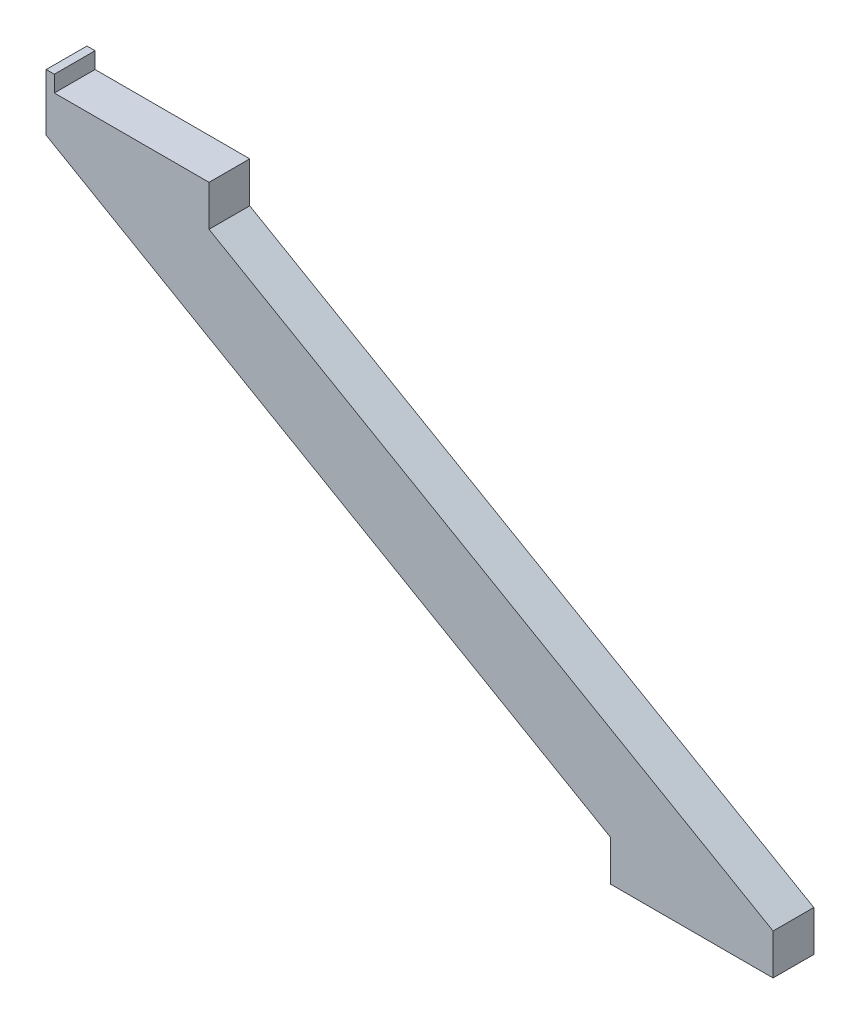
ISO-10303-21;
HEADER;
FILE_DESCRIPTION(('STEP AP214'),'2;1');
FILE_NAME('part.step','',(''),(''),'','','');
FILE_SCHEMA(('AUTOMOTIVE_DESIGN { 1 0 10303 214 1 1 1 1 }'));
ENDSEC;
DATA;
#1=APPLICATION_CONTEXT('core data for automotive mechanical design processes');
#2=APPLICATION_PROTOCOL_DEFINITION('international standard','automotive_design',2000,#1);
#3=PRODUCT_CONTEXT('',#1,'mechanical');
#4=PRODUCT('Part','Part','',(#3));
#5=PRODUCT_RELATED_PRODUCT_CATEGORY('part','',(#4));
#6=PRODUCT_DEFINITION_FORMATION('','',#4);
#7=PRODUCT_DEFINITION_CONTEXT('part definition',#1,'design');
#8=PRODUCT_DEFINITION('design','',#6,#7);
#9=PRODUCT_DEFINITION_SHAPE('','',#8);
#10=(LENGTH_UNIT() NAMED_UNIT(*) SI_UNIT(.MILLI.,.METRE.));
#11=(NAMED_UNIT(*) PLANE_ANGLE_UNIT() SI_UNIT($,.RADIAN.));
#12=(NAMED_UNIT(*) SI_UNIT($,.STERADIAN.) SOLID_ANGLE_UNIT());
#13=UNCERTAINTY_MEASURE_WITH_UNIT(LENGTH_MEASURE(1.E-05),#10,'distance_accuracy_value','');
#14=(GEOMETRIC_REPRESENTATION_CONTEXT(3) GLOBAL_UNCERTAINTY_ASSIGNED_CONTEXT((#13)) GLOBAL_UNIT_ASSIGNED_CONTEXT((#10,
#11,#12)) REPRESENTATION_CONTEXT('',''));
#15=CARTESIAN_POINT('',(0.,0.,0.));
#16=DIRECTION('',(0.,0.,1.));
#17=DIRECTION('',(1.,0.,0.));
#18=AXIS2_PLACEMENT_3D('',#15,#16,#17);
#19=CARTESIAN_POINT('',(446.410161513781,-250.,25.));
#20=DIRECTION('',(-1.,0.,0.));
#21=DIRECTION('',(0.,-1.,0.));
#22=AXIS2_PLACEMENT_3D('',#19,#20,#21);
#23=PLANE('',#22);
#24=DIRECTION('',(0.,1.,0.));
#25=VECTOR('',#24,1.);
#26=CARTESIAN_POINT('',(446.410161513781,-250.,0.));
#27=LINE('',#26,#25);
#28=CARTESIAN_POINT('',(446.410161513781,-250.,0.));
#29=VERTEX_POINT('',#28);
#30=CARTESIAN_POINT('',(446.410161513781,-225.,0.));
#31=VERTEX_POINT('',#30);
#32=EDGE_CURVE('E135',#29,#31,#27,.T.);
#33=ORIENTED_EDGE('',*,*,#32,.T.);
#34=DIRECTION('',(0.,0.,-1.));
#35=VECTOR('',#34,1.);
#36=CARTESIAN_POINT('',(446.410161513781,-225.,25.));
#37=LINE('',#36,#35);
#38=CARTESIAN_POINT('',(446.410161513781,-225.,25.));
#39=VERTEX_POINT('',#38);
#40=EDGE_CURVE('E11',#39,#31,#37,.T.);
#41=ORIENTED_EDGE('',*,*,#40,.F.);
#42=DIRECTION('',(0.,1.,0.));
#43=VECTOR('',#42,1.);
#44=CARTESIAN_POINT('',(446.410161513781,-250.,25.));
#45=LINE('',#44,#43);
#46=CARTESIAN_POINT('',(446.410161513781,-250.,25.));
#47=VERTEX_POINT('',#46);
#48=EDGE_CURVE('E153',#47,#39,#45,.T.);
#49=ORIENTED_EDGE('',*,*,#48,.F.);
#50=DIRECTION('',(0.,0.,-1.));
#51=VECTOR('',#50,1.);
#52=CARTESIAN_POINT('',(446.410161513781,-250.,25.));
#53=LINE('',#52,#51);
#54=EDGE_CURVE('E131',#47,#29,#53,.T.);
#55=ORIENTED_EDGE('',*,*,#54,.T.);
#56=EDGE_LOOP('',(#33,#41,#49,#55));
#57=FACE_BOUND('',#56,.T.);
#58=ADVANCED_FACE('F33',(#57),#23,.F.);
#59=CARTESIAN_POINT('',(446.410161513781,-225.,25.));
#60=DIRECTION('',(-0.499999999999994,-0.866025403784442,0.));
#61=DIRECTION('',(0.866025403784442,-0.499999999999994,0.));
#62=AXIS2_PLACEMENT_3D('',#59,#60,#61);
#63=PLANE('',#62);
#64=DIRECTION('',(-0.866025403784442,0.499999999999994,0.));
#65=VECTOR('',#64,1.);
#66=CARTESIAN_POINT('',(446.410161513781,-225.,0.));
#67=LINE('',#66,#65);
#68=CARTESIAN_POINT('',(100.,-25.,0.));
#69=VERTEX_POINT('',#68);
#70=EDGE_CURVE('E138',#31,#69,#67,.T.);
#71=ORIENTED_EDGE('',*,*,#70,.T.);
#72=DIRECTION('',(0.,0.,-1.));
#73=VECTOR('',#72,1.);
#74=CARTESIAN_POINT('',(100.,-25.,25.));
#75=LINE('',#74,#73);
#76=CARTESIAN_POINT('',(100.,-25.,25.));
#77=VERTEX_POINT('',#76);
#78=EDGE_CURVE('E40',#77,#69,#75,.T.);
#79=ORIENTED_EDGE('',*,*,#78,.F.);
#80=DIRECTION('',(-0.866025403784442,0.499999999999994,0.));
#81=VECTOR('',#80,1.);
#82=CARTESIAN_POINT('',(446.410161513781,-225.,25.));
#83=LINE('',#82,#81);
#84=EDGE_CURVE('E94',#39,#77,#83,.T.);
#85=ORIENTED_EDGE('',*,*,#84,.F.);
#86=ORIENTED_EDGE('',*,*,#40,.T.);
#87=EDGE_LOOP('',(#71,#79,#85,#86));
#88=FACE_BOUND('',#87,.T.);
#89=ADVANCED_FACE('F166',(#88),#63,.F.);
#90=CARTESIAN_POINT('',(100.,0.,25.));
#91=DIRECTION('',(1.,0.,0.));
#92=DIRECTION('',(0.,0.,-1.));
#93=AXIS2_PLACEMENT_3D('',#90,#91,#92);
#94=PLANE('',#93);
#95=DIRECTION('',(0.,-1.,0.));
#96=VECTOR('',#95,1.);
#97=CARTESIAN_POINT('',(100.,0.,0.));
#98=LINE('',#97,#96);
#99=CARTESIAN_POINT('',(100.,0.,0.));
#100=VERTEX_POINT('',#99);
#101=EDGE_CURVE('E142',#100,#69,#98,.T.);
#102=ORIENTED_EDGE('',*,*,#101,.F.);
#103=DIRECTION('',(0.,0.,-1.));
#104=VECTOR('',#103,1.);
#105=CARTESIAN_POINT('',(100.,0.,25.));
#106=LINE('',#105,#104);
#107=CARTESIAN_POINT('',(100.,0.,25.));
#108=VERTEX_POINT('',#107);
#109=EDGE_CURVE('E157',#108,#100,#106,.T.);
#110=ORIENTED_EDGE('',*,*,#109,.F.);
#111=DIRECTION('',(0.,-1.,0.));
#112=VECTOR('',#111,1.);
#113=CARTESIAN_POINT('',(100.,0.,25.));
#114=LINE('',#113,#112);
#115=EDGE_CURVE('E165',#108,#77,#114,.T.);
#116=ORIENTED_EDGE('',*,*,#115,.T.);
#117=ORIENTED_EDGE('',*,*,#78,.T.);
#118=EDGE_LOOP('',(#102,#110,#116,#117));
#119=FACE_BOUND('',#118,.T.);
#120=ADVANCED_FACE('F162',(#119),#94,.T.);
#121=CARTESIAN_POINT('',(0.,0.,25.));
#122=DIRECTION('',(0.,1.,0.));
#123=DIRECTION('',(0.,0.,1.));
#124=AXIS2_PLACEMENT_3D('',#121,#122,#123);
#125=PLANE('',#124);
#126=DIRECTION('',(0.,0.,-1.));
#127=VECTOR('',#126,1.);
#128=CARTESIAN_POINT('',(5.,0.,0.));
#129=LINE('',#128,#127);
#130=CARTESIAN_POINT('',(5.,0.,25.));
#131=VERTEX_POINT('',#130);
#132=CARTESIAN_POINT('',(5.,0.,0.));
#133=VERTEX_POINT('',#132);
#134=EDGE_CURVE('E47',#131,#133,#129,.T.);
#135=ORIENTED_EDGE('',*,*,#134,.F.);
#136=DIRECTION('',(1.,0.,0.));
#137=VECTOR('',#136,1.);
#138=CARTESIAN_POINT('',(0.,0.,25.));
#139=LINE('',#138,#137);
#140=EDGE_CURVE('E176',#131,#108,#139,.T.);
#141=ORIENTED_EDGE('',*,*,#140,.T.);
#142=ORIENTED_EDGE('',*,*,#109,.T.);
#143=DIRECTION('',(1.,0.,0.));
#144=VECTOR('',#143,1.);
#145=CARTESIAN_POINT('',(0.,0.,0.));
#146=LINE('',#145,#144);
#147=EDGE_CURVE('E145',#133,#100,#146,.T.);
#148=ORIENTED_EDGE('',*,*,#147,.F.);
#149=EDGE_LOOP('',(#135,#141,#142,#148));
#150=FACE_BOUND('',#149,.T.);
#151=ADVANCED_FACE('F175',(#150),#125,.T.);
#152=CARTESIAN_POINT('',(0.,0.,25.));
#153=DIRECTION('',(1.,0.,0.));
#154=DIRECTION('',(0.,1.,0.));
#155=AXIS2_PLACEMENT_3D('',#152,#153,#154);
#156=PLANE('',#155);
#157=DIRECTION('',(0.,-1.,0.));
#158=VECTOR('',#157,1.);
#159=CARTESIAN_POINT('',(0.,0.,0.));
#160=LINE('',#159,#158);
#161=CARTESIAN_POINT('',(0.,10.,0.));
#162=VERTEX_POINT('',#161);
#163=CARTESIAN_POINT('',(0.,-25.,0.));
#164=VERTEX_POINT('',#163);
#165=EDGE_CURVE('E147',#162,#164,#160,.T.);
#166=ORIENTED_EDGE('',*,*,#165,.T.);
#167=DIRECTION('',(0.,0.,-1.));
#168=VECTOR('',#167,1.);
#169=CARTESIAN_POINT('',(0.,-25.,25.));
#170=LINE('',#169,#168);
#171=CARTESIAN_POINT('',(0.,-25.,25.));
#172=VERTEX_POINT('',#171);
#173=EDGE_CURVE('E126',#172,#164,#170,.T.);
#174=ORIENTED_EDGE('',*,*,#173,.F.);
#175=DIRECTION('',(0.,-1.,0.));
#176=VECTOR('',#175,1.);
#177=CARTESIAN_POINT('',(0.,0.,25.));
#178=LINE('',#177,#176);
#179=CARTESIAN_POINT('',(0.,10.,25.));
#180=VERTEX_POINT('',#179);
#181=EDGE_CURVE('E114',#180,#172,#178,.T.);
#182=ORIENTED_EDGE('',*,*,#181,.F.);
#183=DIRECTION('',(0.,0.,1.));
#184=VECTOR('',#183,1.);
#185=CARTESIAN_POINT('',(0.,10.,0.));
#186=LINE('',#185,#184);
#187=EDGE_CURVE('E188',#162,#180,#186,.T.);
#188=ORIENTED_EDGE('',*,*,#187,.F.);
#189=EDGE_LOOP('',(#166,#174,#182,#188));
#190=FACE_BOUND('',#189,.T.);
#191=ADVANCED_FACE('F205',(#190),#156,.F.);
#192=CARTESIAN_POINT('',(0.,-25.,25.));
#193=DIRECTION('',(0.499999999999994,0.866025403784442,0.));
#194=DIRECTION('',(-0.866025403784442,0.499999999999994,0.));
#195=AXIS2_PLACEMENT_3D('',#192,#193,#194);
#196=PLANE('',#195);
#197=DIRECTION('',(0.866025403784442,-0.499999999999994,0.));
#198=VECTOR('',#197,1.);
#199=CARTESIAN_POINT('',(0.,-25.,0.));
#200=LINE('',#199,#198);
#201=CARTESIAN_POINT('',(346.410161513781,-225.,0.));
#202=VERTEX_POINT('',#201);
#203=EDGE_CURVE('E123',#164,#202,#200,.T.);
#204=ORIENTED_EDGE('',*,*,#203,.T.);
#205=DIRECTION('',(0.,0.,-1.));
#206=VECTOR('',#205,1.);
#207=CARTESIAN_POINT('',(346.410161513781,-225.,25.));
#208=LINE('',#207,#206);
#209=CARTESIAN_POINT('',(346.410161513781,-225.,25.));
#210=VERTEX_POINT('',#209);
#211=EDGE_CURVE('E120',#210,#202,#208,.T.);
#212=ORIENTED_EDGE('',*,*,#211,.F.);
#213=DIRECTION('',(0.866025403784442,-0.499999999999994,0.));
#214=VECTOR('',#213,1.);
#215=CARTESIAN_POINT('',(0.,-25.,25.));
#216=LINE('',#215,#214);
#217=EDGE_CURVE('E106',#172,#210,#216,.T.);
#218=ORIENTED_EDGE('',*,*,#217,.F.);
#219=ORIENTED_EDGE('',*,*,#173,.T.);
#220=EDGE_LOOP('',(#204,#212,#218,#219));
#221=FACE_BOUND('',#220,.T.);
#222=ADVANCED_FACE('F121',(#221),#196,.F.);
#223=CARTESIAN_POINT('',(346.410161513781,-225.,25.));
#224=DIRECTION('',(1.,0.,0.));
#225=DIRECTION('',(0.,0.,-1.));
#226=AXIS2_PLACEMENT_3D('',#223,#224,#225);
#227=PLANE('',#226);
#228=DIRECTION('',(0.,-1.,0.));
#229=VECTOR('',#228,1.);
#230=CARTESIAN_POINT('',(346.410161513781,-225.,0.));
#231=LINE('',#230,#229);
#232=CARTESIAN_POINT('',(346.410161513781,-250.,0.));
#233=VERTEX_POINT('',#232);
#234=EDGE_CURVE('E150',#202,#233,#231,.T.);
#235=ORIENTED_EDGE('',*,*,#234,.T.);
#236=DIRECTION('',(0.,0.,-1.));
#237=VECTOR('',#236,1.);
#238=CARTESIAN_POINT('',(346.410161513781,-250.,25.));
#239=LINE('',#238,#237);
#240=CARTESIAN_POINT('',(346.410161513781,-250.,25.));
#241=VERTEX_POINT('',#240);
#242=EDGE_CURVE('E127',#241,#233,#239,.T.);
#243=ORIENTED_EDGE('',*,*,#242,.F.);
#244=DIRECTION('',(0.,-1.,0.));
#245=VECTOR('',#244,1.);
#246=CARTESIAN_POINT('',(346.410161513781,-225.,25.));
#247=LINE('',#246,#245);
#248=EDGE_CURVE('E110',#210,#241,#247,.T.);
#249=ORIENTED_EDGE('',*,*,#248,.F.);
#250=ORIENTED_EDGE('',*,*,#211,.T.);
#251=EDGE_LOOP('',(#235,#243,#249,#250));
#252=FACE_BOUND('',#251,.T.);
#253=ADVANCED_FACE('F129',(#252),#227,.F.);
#254=CARTESIAN_POINT('',(346.410161513781,-250.,25.));
#255=DIRECTION('',(0.,1.,0.));
#256=DIRECTION('',(0.,0.,1.));
#257=AXIS2_PLACEMENT_3D('',#254,#255,#256);
#258=PLANE('',#257);
#259=DIRECTION('',(1.,0.,0.));
#260=VECTOR('',#259,1.);
#261=CARTESIAN_POINT('',(346.410161513781,-250.,0.));
#262=LINE('',#261,#260);
#263=EDGE_CURVE('E86',#233,#29,#262,.T.);
#264=ORIENTED_EDGE('',*,*,#263,.T.);
#265=ORIENTED_EDGE('',*,*,#54,.F.);
#266=DIRECTION('',(1.,0.,0.));
#267=VECTOR('',#266,1.);
#268=CARTESIAN_POINT('',(346.410161513781,-250.,25.));
#269=LINE('',#268,#267);
#270=EDGE_CURVE('E56',#241,#47,#269,.T.);
#271=ORIENTED_EDGE('',*,*,#270,.F.);
#272=ORIENTED_EDGE('',*,*,#242,.T.);
#273=EDGE_LOOP('',(#264,#265,#271,#272));
#274=FACE_BOUND('',#273,.T.);
#275=ADVANCED_FACE('F228',(#274),#258,.F.);
#276=CARTESIAN_POINT('',(0.,0.,25.));
#277=DIRECTION('',(0.,0.,-1.));
#278=DIRECTION('',(-1.,0.,0.));
#279=AXIS2_PLACEMENT_3D('',#276,#277,#278);
#280=PLANE('',#279);
#281=ORIENTED_EDGE('',*,*,#48,.T.);
#282=ORIENTED_EDGE('',*,*,#84,.T.);
#283=ORIENTED_EDGE('',*,*,#115,.F.);
#284=ORIENTED_EDGE('',*,*,#140,.F.);
#285=DIRECTION('',(0.,-1.,0.));
#286=VECTOR('',#285,1.);
#287=CARTESIAN_POINT('',(5.,10.,25.));
#288=LINE('',#287,#286);
#289=CARTESIAN_POINT('',(5.,10.,25.));
#290=VERTEX_POINT('',#289);
#291=EDGE_CURVE('E139',#290,#131,#288,.T.);
#292=ORIENTED_EDGE('',*,*,#291,.F.);
#293=DIRECTION('',(1.,0.,0.));
#294=VECTOR('',#293,1.);
#295=CARTESIAN_POINT('',(0.,10.,25.));
#296=LINE('',#295,#294);
#297=EDGE_CURVE('E194',#180,#290,#296,.T.);
#298=ORIENTED_EDGE('',*,*,#297,.F.);
#299=ORIENTED_EDGE('',*,*,#181,.T.);
#300=ORIENTED_EDGE('',*,*,#217,.T.);
#301=ORIENTED_EDGE('',*,*,#248,.T.);
#302=ORIENTED_EDGE('',*,*,#270,.T.);
#303=EDGE_LOOP('',(#281,#282,#283,#284,#292,#298,#299,#300,#301,#302));
#304=FACE_BOUND('',#303,.T.);
#305=ADVANCED_FACE('F108',(#304),#280,.F.);
#306=CARTESIAN_POINT('',(0.,0.,0.));
#307=DIRECTION('',(0.,0.,-1.));
#308=DIRECTION('',(-1.,0.,0.));
#309=AXIS2_PLACEMENT_3D('',#306,#307,#308);
#310=PLANE('',#309);
#311=ORIENTED_EDGE('',*,*,#32,.F.);
#312=ORIENTED_EDGE('',*,*,#263,.F.);
#313=ORIENTED_EDGE('',*,*,#234,.F.);
#314=ORIENTED_EDGE('',*,*,#203,.F.);
#315=ORIENTED_EDGE('',*,*,#165,.F.);
#316=DIRECTION('',(-1.,0.,0.));
#317=VECTOR('',#316,1.);
#318=CARTESIAN_POINT('',(0.,10.,0.));
#319=LINE('',#318,#317);
#320=CARTESIAN_POINT('',(5.,10.,0.));
#321=VERTEX_POINT('',#320);
#322=EDGE_CURVE('E186',#321,#162,#319,.T.);
#323=ORIENTED_EDGE('',*,*,#322,.F.);
#324=DIRECTION('',(0.,-1.,0.));
#325=VECTOR('',#324,1.);
#326=CARTESIAN_POINT('',(5.,10.,0.));
#327=LINE('',#326,#325);
#328=EDGE_CURVE('E174',#321,#133,#327,.T.);
#329=ORIENTED_EDGE('',*,*,#328,.T.);
#330=ORIENTED_EDGE('',*,*,#147,.T.);
#331=ORIENTED_EDGE('',*,*,#101,.T.);
#332=ORIENTED_EDGE('',*,*,#70,.F.);
#333=EDGE_LOOP('',(#311,#312,#313,#314,#315,#323,#329,#330,#331,#332));
#334=FACE_BOUND('',#333,.T.);
#335=ADVANCED_FACE('F170',(#334),#310,.T.);
#336=CARTESIAN_POINT('',(5.,10.,0.));
#337=DIRECTION('',(-1.,0.,0.));
#338=DIRECTION('',(0.,0.,1.));
#339=AXIS2_PLACEMENT_3D('',#336,#337,#338);
#340=PLANE('',#339);
#341=ORIENTED_EDGE('',*,*,#134,.T.);
#342=ORIENTED_EDGE('',*,*,#328,.F.);
#343=DIRECTION('',(0.,0.,-1.));
#344=VECTOR('',#343,1.);
#345=CARTESIAN_POINT('',(5.,10.,0.));
#346=LINE('',#345,#344);
#347=EDGE_CURVE('E191',#290,#321,#346,.T.);
#348=ORIENTED_EDGE('',*,*,#347,.F.);
#349=ORIENTED_EDGE('',*,*,#291,.T.);
#350=EDGE_LOOP('',(#341,#342,#348,#349));
#351=FACE_BOUND('',#350,.T.);
#352=ADVANCED_FACE('F212',(#351),#340,.F.);
#353=CARTESIAN_POINT('',(0.,10.,0.));
#354=DIRECTION('',(0.,1.,0.));
#355=DIRECTION('',(0.,0.,1.));
#356=AXIS2_PLACEMENT_3D('',#353,#354,#355);
#357=PLANE('',#356);
#358=ORIENTED_EDGE('',*,*,#187,.T.);
#359=ORIENTED_EDGE('',*,*,#297,.T.);
#360=ORIENTED_EDGE('',*,*,#347,.T.);
#361=ORIENTED_EDGE('',*,*,#322,.T.);
#362=EDGE_LOOP('',(#358,#359,#360,#361));
#363=FACE_BOUND('',#362,.T.);
#364=ADVANCED_FACE('F201',(#363),#357,.T.);
#365=CLOSED_SHELL('',(#58,#89,#120,#151,#191,#222,#253,#275,#305,#335,#352,#364));
#366=MANIFOLD_SOLID_BREP('B2',#365);
#367=ADVANCED_BREP_SHAPE_REPRESENTATION('',(#18,#366),#14);
#368=SHAPE_DEFINITION_REPRESENTATION(#9,#367);
ENDSEC;
END-ISO-10303-21;
